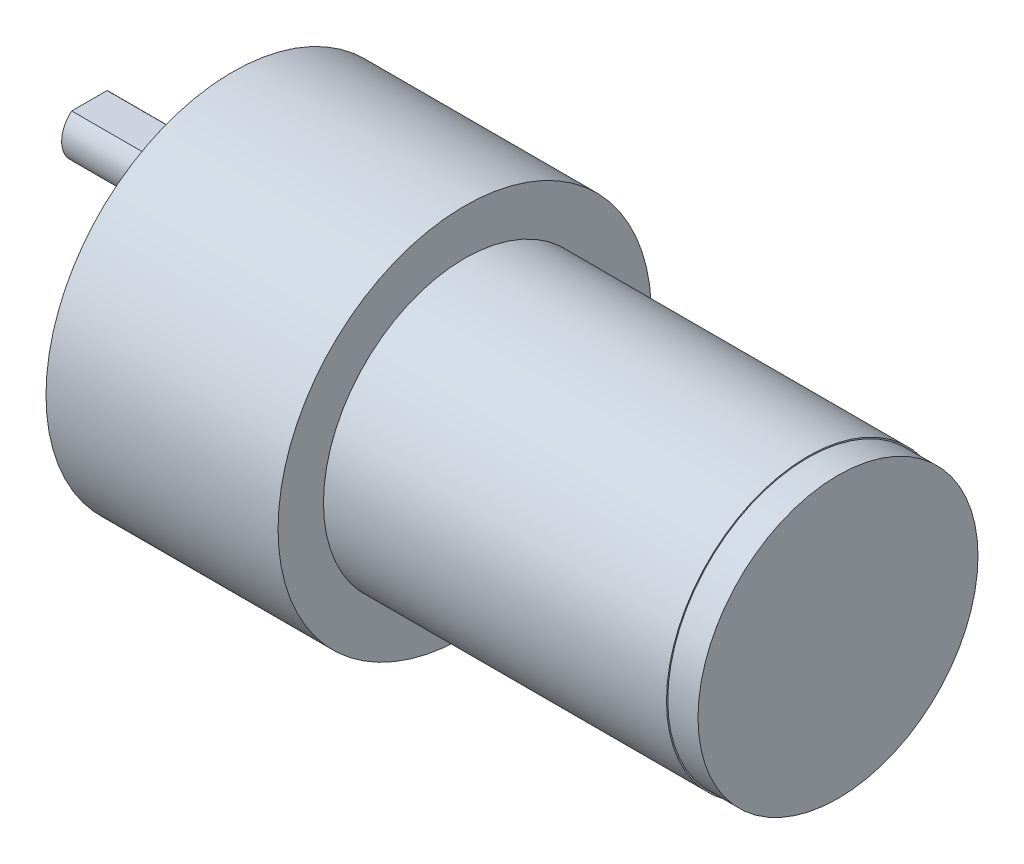
ISO-10303-21;
HEADER;
FILE_DESCRIPTION(('STEP AP214'),'2;1');
FILE_NAME('part.step','',(''),(''),'','','');
FILE_SCHEMA(('AUTOMOTIVE_DESIGN { 1 0 10303 214 1 1 1 1 }'));
ENDSEC;
DATA;
#1=APPLICATION_CONTEXT('core data for automotive mechanical design processes');
#2=APPLICATION_PROTOCOL_DEFINITION('international standard','automotive_design',2000,#1);
#3=PRODUCT_CONTEXT('',#1,'mechanical');
#4=PRODUCT('Part','Part','',(#3));
#5=PRODUCT_RELATED_PRODUCT_CATEGORY('part','',(#4));
#6=PRODUCT_DEFINITION_FORMATION('','',#4);
#7=PRODUCT_DEFINITION_CONTEXT('part definition',#1,'design');
#8=PRODUCT_DEFINITION('design','',#6,#7);
#9=PRODUCT_DEFINITION_SHAPE('','',#8);
#10=(LENGTH_UNIT() NAMED_UNIT(*) SI_UNIT(.MILLI.,.METRE.));
#11=(NAMED_UNIT(*) PLANE_ANGLE_UNIT() SI_UNIT($,.RADIAN.));
#12=(NAMED_UNIT(*) SI_UNIT($,.STERADIAN.) SOLID_ANGLE_UNIT());
#13=UNCERTAINTY_MEASURE_WITH_UNIT(LENGTH_MEASURE(1.E-05),#10,'distance_accuracy_value','');
#14=(GEOMETRIC_REPRESENTATION_CONTEXT(3) GLOBAL_UNCERTAINTY_ASSIGNED_CONTEXT((#13)) GLOBAL_UNIT_ASSIGNED_CONTEXT((#10,
#11,#12)) REPRESENTATION_CONTEXT('',''));
#15=CARTESIAN_POINT('',(0.,0.,0.));
#16=DIRECTION('',(0.,0.,1.));
#17=DIRECTION('',(1.,0.,0.));
#18=AXIS2_PLACEMENT_3D('',#15,#16,#17);
#19=CARTESIAN_POINT('',(-34.,0.,0.));
#20=DIRECTION('',(1.,0.,0.));
#21=DIRECTION('',(0.,0.,-1.));
#22=AXIS2_PLACEMENT_3D('',#19,#20,#21);
#23=CYLINDRICAL_SURFACE('',#22,14.);
#24=CARTESIAN_POINT('',(-34.,0.,0.));
#25=DIRECTION('',(1.,0.,0.));
#26=DIRECTION('',(0.,0.,-1.));
#27=AXIS2_PLACEMENT_3D('',#24,#25,#26);
#28=CIRCLE('',#27,14.);
#29=CARTESIAN_POINT('',(-34.,0.,-14.));
#30=VERTEX_POINT('',#29);
#31=EDGE_CURVE('E96',#30,#30,#28,.T.);
#32=ORIENTED_EDGE('',*,*,#31,.T.);
#33=EDGE_LOOP('',(#32));
#34=FACE_BOUND('',#33,.T.);
#35=CARTESIAN_POINT('',(0.,0.,0.));
#36=DIRECTION('',(1.,0.,0.));
#37=DIRECTION('',(0.,0.,-1.));
#38=AXIS2_PLACEMENT_3D('',#35,#36,#37);
#39=CIRCLE('',#38,14.);
#40=CARTESIAN_POINT('',(0.,0.,-14.));
#41=VERTEX_POINT('',#40);
#42=EDGE_CURVE('E42',#41,#41,#39,.T.);
#43=ORIENTED_EDGE('',*,*,#42,.F.);
#44=EDGE_LOOP('',(#43));
#45=FACE_BOUND('',#44,.T.);
#46=ADVANCED_FACE('F39',(#34,#45),#23,.T.);
#47=CARTESIAN_POINT('',(0.,0.,0.));
#48=DIRECTION('',(1.,0.,0.));
#49=DIRECTION('',(0.,0.,-1.));
#50=AXIS2_PLACEMENT_3D('',#47,#48,#49);
#51=PLANE('',#50);
#52=CARTESIAN_POINT('',(0.,0.,0.));
#53=DIRECTION('',(1.,0.,0.));
#54=DIRECTION('',(0.,0.,-1.));
#55=AXIS2_PLACEMENT_3D('',#52,#53,#54);
#56=CIRCLE('',#55,13.875);
#57=CARTESIAN_POINT('',(0.,0.,-13.875));
#58=VERTEX_POINT('',#57);
#59=EDGE_CURVE('E11',#58,#58,#56,.T.);
#60=ORIENTED_EDGE('',*,*,#59,.F.);
#61=EDGE_LOOP('',(#60));
#62=FACE_BOUND('',#61,.T.);
#63=ORIENTED_EDGE('',*,*,#42,.T.);
#64=EDGE_LOOP('',(#63));
#65=FACE_BOUND('',#64,.T.);
#66=ADVANCED_FACE('F104',(#62,#65),#51,.T.);
#67=CARTESIAN_POINT('',(-57.,0.,0.));
#68=DIRECTION('',(1.,0.,0.));
#69=DIRECTION('',(0.,0.,-1.));
#70=AXIS2_PLACEMENT_3D('',#67,#68,#69);
#71=CYLINDRICAL_SURFACE('',#70,18.5);
#72=CARTESIAN_POINT('',(-57.,0.,0.));
#73=DIRECTION('',(-1.,0.,0.));
#74=DIRECTION('',(0.,0.,1.));
#75=AXIS2_PLACEMENT_3D('',#72,#73,#74);
#76=CIRCLE('',#75,18.5);
#77=CARTESIAN_POINT('',(-57.,0.,18.5));
#78=VERTEX_POINT('',#77);
#79=EDGE_CURVE('E93',#78,#78,#76,.T.);
#80=ORIENTED_EDGE('',*,*,#79,.F.);
#81=EDGE_LOOP('',(#80));
#82=FACE_BOUND('',#81,.T.);
#83=CARTESIAN_POINT('',(-34.,0.,0.));
#84=DIRECTION('',(-1.,0.,0.));
#85=DIRECTION('',(0.,0.,1.));
#86=AXIS2_PLACEMENT_3D('',#83,#84,#85);
#87=CIRCLE('',#86,18.5);
#88=CARTESIAN_POINT('',(-34.,0.,18.5));
#89=VERTEX_POINT('',#88);
#90=EDGE_CURVE('E84',#89,#89,#87,.T.);
#91=ORIENTED_EDGE('',*,*,#90,.T.);
#92=EDGE_LOOP('',(#91));
#93=FACE_BOUND('',#92,.T.);
#94=ADVANCED_FACE('F110',(#82,#93),#71,.T.);
#95=CARTESIAN_POINT('',(-57.,0.,0.));
#96=DIRECTION('',(-1.,0.,0.));
#97=DIRECTION('',(0.,0.,1.));
#98=AXIS2_PLACEMENT_3D('',#95,#96,#97);
#99=PLANE('',#98);
#100=CARTESIAN_POINT('',(-57.,0.,-6.8));
#101=DIRECTION('',(-1.,0.,0.));
#102=DIRECTION('',(0.,0.,1.));
#103=AXIS2_PLACEMENT_3D('',#100,#101,#102);
#104=CIRCLE('',#103,6.);
#105=CARTESIAN_POINT('',(-57.,0.,-0.799999999999999));
#106=VERTEX_POINT('',#105);
#107=EDGE_CURVE('E89',#106,#106,#104,.T.);
#108=ORIENTED_EDGE('',*,*,#107,.F.);
#109=EDGE_LOOP('',(#108));
#110=FACE_BOUND('',#109,.T.);
#111=ORIENTED_EDGE('',*,*,#79,.T.);
#112=EDGE_LOOP('',(#111));
#113=FACE_BOUND('',#112,.T.);
#114=ADVANCED_FACE('F115',(#110,#113),#99,.T.);
#115=CARTESIAN_POINT('',(-34.,0.,0.));
#116=DIRECTION('',(-1.,0.,0.));
#117=DIRECTION('',(0.,0.,1.));
#118=AXIS2_PLACEMENT_3D('',#115,#116,#117);
#119=PLANE('',#118);
#120=ORIENTED_EDGE('',*,*,#31,.F.);
#121=EDGE_LOOP('',(#120));
#122=FACE_BOUND('',#121,.T.);
#123=ORIENTED_EDGE('',*,*,#90,.F.);
#124=EDGE_LOOP('',(#123));
#125=FACE_BOUND('',#124,.T.);
#126=ADVANCED_FACE('F120',(#122,#125),#119,.F.);
#127=CARTESIAN_POINT('',(-63.,0.,-6.8));
#128=DIRECTION('',(1.,0.,0.));
#129=DIRECTION('',(0.,0.,-1.));
#130=AXIS2_PLACEMENT_3D('',#127,#128,#129);
#131=CYLINDRICAL_SURFACE('',#130,6.);
#132=CARTESIAN_POINT('',(-63.,0.,-6.8));
#133=DIRECTION('',(-1.,0.,0.));
#134=DIRECTION('',(0.,0.,1.));
#135=AXIS2_PLACEMENT_3D('',#132,#133,#134);
#136=CIRCLE('',#135,6.);
#137=CARTESIAN_POINT('',(-63.,0.,-0.799999999999999));
#138=VERTEX_POINT('',#137);
#139=EDGE_CURVE('E81',#138,#138,#136,.T.);
#140=ORIENTED_EDGE('',*,*,#139,.F.);
#141=EDGE_LOOP('',(#140));
#142=FACE_BOUND('',#141,.T.);
#143=ORIENTED_EDGE('',*,*,#107,.T.);
#144=EDGE_LOOP('',(#143));
#145=FACE_BOUND('',#144,.T.);
#146=ADVANCED_FACE('F123',(#142,#145),#131,.T.);
#147=CARTESIAN_POINT('',(-63.,0.,-6.8));
#148=DIRECTION('',(-1.,0.,0.));
#149=DIRECTION('',(0.,0.,1.));
#150=AXIS2_PLACEMENT_3D('',#147,#148,#149);
#151=PLANE('',#150);
#152=CARTESIAN_POINT('',(-63.,0.,-6.8));
#153=DIRECTION('',(-1.,0.,0.));
#154=DIRECTION('',(0.,0.,1.));
#155=AXIS2_PLACEMENT_3D('',#152,#153,#154);
#156=CIRCLE('',#155,2.75);
#157=CARTESIAN_POINT('',(-63.,0.,-4.05));
#158=VERTEX_POINT('',#157);
#159=EDGE_CURVE('E47',#158,#158,#156,.T.);
#160=ORIENTED_EDGE('',*,*,#159,.F.);
#161=EDGE_LOOP('',(#160));
#162=FACE_BOUND('',#161,.T.);
#163=ORIENTED_EDGE('',*,*,#139,.T.);
#164=EDGE_LOOP('',(#163));
#165=FACE_BOUND('',#164,.T.);
#166=ADVANCED_FACE('F130',(#162,#165),#151,.T.);
#167=CARTESIAN_POINT('',(-78.,0.,-6.8));
#168=DIRECTION('',(1.,0.,0.));
#169=DIRECTION('',(0.,0.,-1.));
#170=AXIS2_PLACEMENT_3D('',#167,#168,#169);
#171=CYLINDRICAL_SURFACE('',#170,2.75);
#172=CARTESIAN_POINT('',(-78.,0.,-6.8));
#173=DIRECTION('',(-1.,0.,0.));
#174=DIRECTION('',(0.,0.,1.));
#175=AXIS2_PLACEMENT_3D('',#172,#173,#174);
#176=CIRCLE('',#175,2.75);
#177=CARTESIAN_POINT('',(-78.,2.12132034355964,-8.55));
#178=VERTEX_POINT('',#177);
#179=CARTESIAN_POINT('',(-78.,2.12132034355964,-5.05));
#180=VERTEX_POINT('',#179);
#181=EDGE_CURVE('E78',#178,#180,#176,.T.);
#182=ORIENTED_EDGE('',*,*,#181,.F.);
#183=DIRECTION('',(-1.,0.,0.));
#184=VECTOR('',#183,1.);
#185=CARTESIAN_POINT('',(-66.,2.12132034355964,-8.55));
#186=LINE('',#185,#184);
#187=CARTESIAN_POINT('',(-66.,2.12132034355964,-8.55));
#188=VERTEX_POINT('',#187);
#189=EDGE_CURVE('E55',#188,#178,#186,.T.);
#190=ORIENTED_EDGE('',*,*,#189,.F.);
#191=CARTESIAN_POINT('',(-66.,0.,-6.8));
#192=DIRECTION('',(-1.,0.,0.));
#193=DIRECTION('',(0.,0.,1.));
#194=AXIS2_PLACEMENT_3D('',#191,#192,#193);
#195=CIRCLE('',#194,2.75);
#196=CARTESIAN_POINT('',(-66.,2.12132034355964,-5.05));
#197=VERTEX_POINT('',#196);
#198=EDGE_CURVE('E71',#197,#188,#195,.T.);
#199=ORIENTED_EDGE('',*,*,#198,.F.);
#200=DIRECTION('',(-1.,0.,0.));
#201=VECTOR('',#200,1.);
#202=CARTESIAN_POINT('',(-66.,2.12132034355964,-5.05));
#203=LINE('',#202,#201);
#204=EDGE_CURVE('E61',#197,#180,#203,.T.);
#205=ORIENTED_EDGE('',*,*,#204,.T.);
#206=EDGE_LOOP('',(#182,#190,#199,#205));
#207=FACE_BOUND('',#206,.T.);
#208=ORIENTED_EDGE('',*,*,#159,.T.);
#209=EDGE_LOOP('',(#208));
#210=FACE_BOUND('',#209,.T.);
#211=ADVANCED_FACE('F76',(#207,#210),#171,.T.);
#212=CARTESIAN_POINT('',(-78.,0.,-6.8));
#213=DIRECTION('',(-1.,0.,0.));
#214=DIRECTION('',(0.,0.,1.));
#215=AXIS2_PLACEMENT_3D('',#212,#213,#214);
#216=PLANE('',#215);
#217=DIRECTION('',(0.,0.,1.));
#218=VECTOR('',#217,1.);
#219=CARTESIAN_POINT('',(-78.,2.12132034355964,-8.55));
#220=LINE('',#219,#218);
#221=EDGE_CURVE('E66',#178,#180,#220,.T.);
#222=ORIENTED_EDGE('',*,*,#221,.F.);
#223=ORIENTED_EDGE('',*,*,#181,.T.);
#224=EDGE_LOOP('',(#222,#223));
#225=FACE_BOUND('',#224,.T.);
#226=ADVANCED_FACE('F80',(#225),#216,.T.);
#227=CARTESIAN_POINT('',(-66.,2.12132034355964,-8.55));
#228=DIRECTION('',(0.,-1.,0.));
#229=DIRECTION('',(0.,0.,-1.));
#230=AXIS2_PLACEMENT_3D('',#227,#228,#229);
#231=PLANE('',#230);
#232=ORIENTED_EDGE('',*,*,#221,.T.);
#233=ORIENTED_EDGE('',*,*,#204,.F.);
#234=DIRECTION('',(0.,0.,1.));
#235=VECTOR('',#234,1.);
#236=CARTESIAN_POINT('',(-66.,2.12132034355964,-8.55));
#237=LINE('',#236,#235);
#238=EDGE_CURVE('E159',#188,#197,#237,.T.);
#239=ORIENTED_EDGE('',*,*,#238,.F.);
#240=ORIENTED_EDGE('',*,*,#189,.T.);
#241=EDGE_LOOP('',(#232,#233,#239,#240));
#242=FACE_BOUND('',#241,.T.);
#243=ADVANCED_FACE('F67',(#242),#231,.F.);
#244=CARTESIAN_POINT('',(-66.,0.,-6.8));
#245=DIRECTION('',(-1.,0.,0.));
#246=DIRECTION('',(0.,0.,1.));
#247=AXIS2_PLACEMENT_3D('',#244,#245,#246);
#248=PLANE('',#247);
#249=ORIENTED_EDGE('',*,*,#198,.T.);
#250=ORIENTED_EDGE('',*,*,#238,.T.);
#251=EDGE_LOOP('',(#249,#250));
#252=FACE_BOUND('',#251,.T.);
#253=ADVANCED_FACE('F141',(#252),#248,.T.);
#254=CARTESIAN_POINT('',(3.,0.,0.));
#255=DIRECTION('',(-1.,0.,0.));
#256=DIRECTION('',(0.,0.,1.));
#257=AXIS2_PLACEMENT_3D('',#254,#255,#256);
#258=CYLINDRICAL_SURFACE('',#257,13.875);
#259=CARTESIAN_POINT('',(3.,0.,0.));
#260=DIRECTION('',(1.,0.,0.));
#261=DIRECTION('',(0.,0.,-1.));
#262=AXIS2_PLACEMENT_3D('',#259,#260,#261);
#263=CIRCLE('',#262,13.875);
#264=CARTESIAN_POINT('',(3.,0.,-13.875));
#265=VERTEX_POINT('',#264);
#266=EDGE_CURVE('E72',#265,#265,#263,.T.);
#267=ORIENTED_EDGE('',*,*,#266,.F.);
#268=EDGE_LOOP('',(#267));
#269=FACE_BOUND('',#268,.T.);
#270=ORIENTED_EDGE('',*,*,#59,.T.);
#271=EDGE_LOOP('',(#270));
#272=FACE_BOUND('',#271,.T.);
#273=ADVANCED_FACE('F144',(#269,#272),#258,.T.);
#274=CARTESIAN_POINT('',(3.,0.,0.));
#275=DIRECTION('',(1.,0.,0.));
#276=DIRECTION('',(0.,0.,-1.));
#277=AXIS2_PLACEMENT_3D('',#274,#275,#276);
#278=PLANE('',#277);
#279=ORIENTED_EDGE('',*,*,#266,.T.);
#280=EDGE_LOOP('',(#279));
#281=FACE_BOUND('',#280,.T.);
#282=ADVANCED_FACE('F148',(#281),#278,.T.);
#283=CLOSED_SHELL('',(#46,#66,#94,#114,#126,#146,#166,#211,#226,#243,#253,#273,#282));
#284=MANIFOLD_SOLID_BREP('B2',#283);
#285=ADVANCED_BREP_SHAPE_REPRESENTATION('',(#18,#284),#14);
#286=SHAPE_DEFINITION_REPRESENTATION(#9,#285);
ENDSEC;
END-ISO-10303-21;
